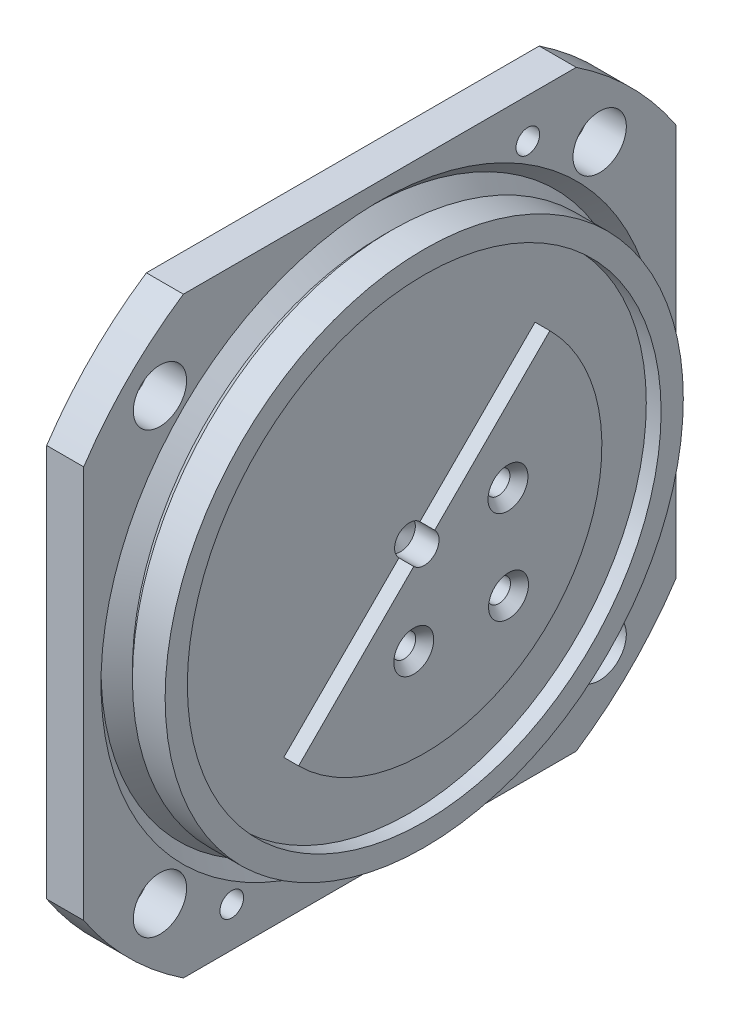
ISO-10303-21;
HEADER;
FILE_DESCRIPTION(('STEP AP214'),'2;1');
FILE_NAME('part.step','',(''),(''),'','','');
FILE_SCHEMA(('AUTOMOTIVE_DESIGN { 1 0 10303 214 1 1 1 1 }'));
ENDSEC;
DATA;
#1=APPLICATION_CONTEXT('core data for automotive mechanical design processes');
#2=APPLICATION_PROTOCOL_DEFINITION('international standard','automotive_design',2000,#1);
#3=PRODUCT_CONTEXT('',#1,'mechanical');
#4=PRODUCT('Part','Part','',(#3));
#5=PRODUCT_RELATED_PRODUCT_CATEGORY('part','',(#4));
#6=PRODUCT_DEFINITION_FORMATION('','',#4);
#7=PRODUCT_DEFINITION_CONTEXT('part definition',#1,'design');
#8=PRODUCT_DEFINITION('design','',#6,#7);
#9=PRODUCT_DEFINITION_SHAPE('','',#8);
#10=(LENGTH_UNIT() NAMED_UNIT(*) SI_UNIT(.MILLI.,.METRE.));
#11=(NAMED_UNIT(*) PLANE_ANGLE_UNIT() SI_UNIT($,.RADIAN.));
#12=(NAMED_UNIT(*) SI_UNIT($,.STERADIAN.) SOLID_ANGLE_UNIT());
#13=UNCERTAINTY_MEASURE_WITH_UNIT(LENGTH_MEASURE(1.E-05),#10,'distance_accuracy_value','');
#14=(GEOMETRIC_REPRESENTATION_CONTEXT(3) GLOBAL_UNCERTAINTY_ASSIGNED_CONTEXT((#13)) GLOBAL_UNIT_ASSIGNED_CONTEXT((#10,
#11,#12)) REPRESENTATION_CONTEXT('',''));
#15=CARTESIAN_POINT('',(0.,0.,0.));
#16=DIRECTION('',(0.,0.,1.));
#17=DIRECTION('',(1.,0.,0.));
#18=AXIS2_PLACEMENT_3D('',#15,#16,#17);
#19=CARTESIAN_POINT('',(0.401117335453598,0.0481695556244104,0.));
#20=DIRECTION('',(1.,0.,0.));
#21=DIRECTION('',(0.,0.,-1.));
#22=AXIS2_PLACEMENT_3D('',#19,#20,#21);
#23=CYLINDRICAL_SURFACE('',#22,17.5);
#24=CARTESIAN_POINT('',(1.50632617985044,0.0481695556244104,0.));
#25=DIRECTION('',(1.,0.,0.));
#26=DIRECTION('',(0.,0.,-1.));
#27=AXIS2_PLACEMENT_3D('',#24,#25,#26);
#28=CIRCLE('',#27,17.5);
#29=CARTESIAN_POINT('',(1.50632617985044,0.0481695556244104,-17.5));
#30=VERTEX_POINT('',#29);
#31=EDGE_CURVE('E19',#30,#30,#28,.T.);
#32=ORIENTED_EDGE('',*,*,#31,.F.);
#33=EDGE_LOOP('',(#32));
#34=FACE_BOUND('',#33,.T.);
#35=CARTESIAN_POINT('',(-0.704091508943475,0.0481695556244104,0.));
#36=DIRECTION('',(1.,0.,0.));
#37=DIRECTION('',(0.,1.,0.));
#38=AXIS2_PLACEMENT_3D('',#35,#36,#37);
#39=CIRCLE('',#38,17.5000000000002);
#40=CARTESIAN_POINT('',(-0.704091508943473,17.5481695556246,0.));
#41=VERTEX_POINT('',#40);
#42=EDGE_CURVE('E127',#41,#41,#39,.F.);
#43=ORIENTED_EDGE('',*,*,#42,.F.);
#44=EDGE_LOOP('',(#43));
#45=FACE_BOUND('',#44,.T.);
#46=ADVANCED_FACE('F16',(#34,#45),#23,.T.);
#47=CARTESIAN_POINT('',(1.50632617985044,8.79816955562441,0.));
#48=DIRECTION('',(1.,0.,0.));
#49=DIRECTION('',(0.,0.,-1.));
#50=AXIS2_PLACEMENT_3D('',#47,#48,#49);
#51=PLANE('',#50);
#52=CARTESIAN_POINT('',(1.50632617985044,0.0481695556244104,0.));
#53=DIRECTION('',(-1.,0.,0.));
#54=DIRECTION('',(0.,0.,1.));
#55=AXIS2_PLACEMENT_3D('',#52,#53,#54);
#56=CIRCLE('',#55,16.);
#57=CARTESIAN_POINT('',(1.50632617985044,0.0481695556244104,16.));
#58=VERTEX_POINT('',#57);
#59=EDGE_CURVE('E126',#58,#58,#56,.T.);
#60=ORIENTED_EDGE('',*,*,#59,.T.);
#61=EDGE_LOOP('',(#60));
#62=FACE_BOUND('',#61,.T.);
#63=ORIENTED_EDGE('',*,*,#31,.T.);
#64=EDGE_LOOP('',(#63));
#65=FACE_BOUND('',#64,.T.);
#66=ADVANCED_FACE('F251',(#62,#65),#51,.T.);
#67=CARTESIAN_POINT('',(-0.704091508943472,0.04816955562441,0.));
#68=DIRECTION('',(1.,0.,0.));
#69=DIRECTION('',(0.,0.,-1.));
#70=AXIS2_PLACEMENT_3D('',#67,#68,#69);
#71=CONICAL_SURFACE('',#70,17.5000000000002,0.785398163397466);
#72=ORIENTED_EDGE('',*,*,#42,.T.);
#73=EDGE_LOOP('',(#72));
#74=FACE_BOUND('',#73,.T.);
#75=CARTESIAN_POINT('',(-1.28154178579381,0.0481695556244104,0.));
#76=DIRECTION('',(-1.,0.,0.));
#77=DIRECTION('',(0.,1.,0.));
#78=AXIS2_PLACEMENT_3D('',#75,#76,#77);
#79=CIRCLE('',#78,16.9225497231494);
#80=CARTESIAN_POINT('',(-1.28154178579381,16.9707192787738,0.));
#81=VERTEX_POINT('',#80);
#82=EDGE_CURVE('E148',#81,#81,#79,.T.);
#83=ORIENTED_EDGE('',*,*,#82,.F.);
#84=EDGE_LOOP('',(#83));
#85=FACE_BOUND('',#84,.T.);
#86=ADVANCED_FACE('F258',(#74,#85),#71,.T.);
#87=CARTESIAN_POINT('',(1.50632617985044,0.0481695556244104,0.));
#88=DIRECTION('',(-1.,0.,0.));
#89=DIRECTION('',(0.,0.,1.));
#90=AXIS2_PLACEMENT_3D('',#87,#88,#89);
#91=CYLINDRICAL_SURFACE('',#90,16.);
#92=ORIENTED_EDGE('',*,*,#59,.F.);
#93=EDGE_LOOP('',(#92));
#94=FACE_BOUND('',#93,.T.);
#95=CARTESIAN_POINT('',(0.506326179850444,0.0481695556244104,0.));
#96=DIRECTION('',(-1.,0.,0.));
#97=DIRECTION('',(0.,0.,1.));
#98=AXIS2_PLACEMENT_3D('',#95,#96,#97);
#99=CIRCLE('',#98,16.);
#100=CARTESIAN_POINT('',(0.506326179850444,0.0481695556244104,16.));
#101=VERTEX_POINT('',#100);
#102=EDGE_CURVE('E146',#101,#101,#99,.F.);
#103=ORIENTED_EDGE('',*,*,#102,.F.);
#104=EDGE_LOOP('',(#103));
#105=FACE_BOUND('',#104,.T.);
#106=ADVANCED_FACE('F254',(#94,#105),#91,.F.);
#107=CARTESIAN_POINT('',(-2.34220195757365,0.04816955562441,0.));
#108=DIRECTION('',(-1.,0.,0.));
#109=DIRECTION('',(0.,0.,1.));
#110=AXIS2_PLACEMENT_3D('',#107,#108,#109);
#111=CONICAL_SURFACE('',#110,17.9832098949292,0.785398163397436);
#112=ORIENTED_EDGE('',*,*,#82,.T.);
#113=EDGE_LOOP('',(#112));
#114=FACE_BOUND('',#113,.T.);
#115=CARTESIAN_POINT('',(-2.34220195757364,0.0481695556244104,0.));
#116=DIRECTION('',(1.,0.,0.));
#117=DIRECTION('',(0.,1.,0.));
#118=AXIS2_PLACEMENT_3D('',#115,#116,#117);
#119=CIRCLE('',#118,17.9832098949297);
#120=CARTESIAN_POINT('',(-2.34220195757365,18.0313794505541,0.));
#121=VERTEX_POINT('',#120);
#122=EDGE_CURVE('E115',#121,#121,#119,.F.);
#123=ORIENTED_EDGE('',*,*,#122,.F.);
#124=EDGE_LOOP('',(#123));
#125=FACE_BOUND('',#124,.T.);
#126=ADVANCED_FACE('F257',(#114,#125),#111,.T.);
#127=CARTESIAN_POINT('',(-0.0936738202312881,0.0481695556244104,0.));
#128=DIRECTION('',(1.,0.,0.));
#129=DIRECTION('',(0.,0.,-1.));
#130=AXIS2_PLACEMENT_3D('',#127,#128,#129);
#131=CONICAL_SURFACE('',#130,0.99999999991951,1.02974425857823);
#132=CARTESIAN_POINT('',(-0.694534439247718,0.0481695556244104,-1.4210854715202E-10));
#133=VERTEX_POINT('',#132);
#134=VERTEX_LOOP('',#133);
#135=FACE_BOUND('',#134,.T.);
#136=CARTESIAN_POINT('',(-0.0936738201495557,0.0481695556244104,0.));
#137=DIRECTION('',(1.,0.,0.));
#138=DIRECTION('',(0.,1.,0.));
#139=AXIS2_PLACEMENT_3D('',#136,#137,#138);
#140=CIRCLE('',#139,1.);
#141=CARTESIAN_POINT('',(-0.0936738201495557,1.04816955562441,0.));
#142=VERTEX_POINT('',#141);
#143=EDGE_CURVE('E114',#142,#142,#140,.T.);
#144=ORIENTED_EDGE('',*,*,#143,.T.);
#145=EDGE_LOOP('',(#144));
#146=FACE_BOUND('',#145,.T.);
#147=ADVANCED_FACE('F264',(#135,#146),#131,.F.);
#148=CARTESIAN_POINT('',(0.506326179850444,0.0481695556244101,-1.45454545454545));
#149=DIRECTION('',(1.,0.,0.));
#150=DIRECTION('',(0.,1.,0.));
#151=AXIS2_PLACEMENT_3D('',#148,#149,#150);
#152=PLANE('',#151);
#153=ORIENTED_EDGE('',*,*,#102,.T.);
#154=EDGE_LOOP('',(#153));
#155=FACE_BOUND('',#154,.T.);
#156=CARTESIAN_POINT('',(0.506326179850444,0.0481695556244104,0.));
#157=DIRECTION('',(-1.,0.,0.));
#158=DIRECTION('',(0.,0.,1.));
#159=AXIS2_PLACEMENT_3D('',#156,#157,#158);
#160=CIRCLE('',#159,12.);
#161=CARTESIAN_POINT('',(0.506326179850444,-8.43711181861417,8.48528137423856));
#162=VERTEX_POINT('',#161);
#163=CARTESIAN_POINT('',(0.506326179850444,8.53345092986299,-8.48528137423857));
#164=VERTEX_POINT('',#163);
#165=EDGE_CURVE('E144',#162,#164,#160,.F.);
#166=ORIENTED_EDGE('',*,*,#165,.F.);
#167=DIRECTION('',(0.,-0.707106781186548,0.707106781186547));
#168=VECTOR('',#167,1.);
#169=CARTESIAN_POINT('',(0.506326179850444,0.0481695556244104,0.));
#170=LINE('',#169,#168);
#171=CARTESIAN_POINT('',(0.506326179850444,-0.658937225562138,0.707106781186547));
#172=VERTEX_POINT('',#171);
#173=EDGE_CURVE('E110',#172,#162,#170,.T.);
#174=ORIENTED_EDGE('',*,*,#173,.F.);
#175=CARTESIAN_POINT('',(0.506326179850444,0.0481695556244104,0.));
#176=DIRECTION('',(1.,0.,0.));
#177=DIRECTION('',(0.,1.,0.));
#178=AXIS2_PLACEMENT_3D('',#175,#176,#177);
#179=CIRCLE('',#178,1.);
#180=CARTESIAN_POINT('',(0.506326179850444,0.755276336810958,-0.707106781186548));
#181=VERTEX_POINT('',#180);
#182=EDGE_CURVE('E104',#172,#181,#179,.F.);
#183=ORIENTED_EDGE('',*,*,#182,.T.);
#184=DIRECTION('',(0.,-0.707106781186548,0.707106781186547));
#185=VECTOR('',#184,1.);
#186=CARTESIAN_POINT('',(0.506326179850444,0.0481695556244104,0.));
#187=LINE('',#186,#185);
#188=EDGE_CURVE('E109',#164,#181,#187,.T.);
#189=ORIENTED_EDGE('',*,*,#188,.F.);
#190=EDGE_LOOP('',(#166,#174,#183,#189));
#191=FACE_BOUND('',#190,.T.);
#192=ADVANCED_FACE('F107',(#155,#191),#152,.T.);
#193=CARTESIAN_POINT('',(-2.34220195757364,0.04816955562441,0.));
#194=DIRECTION('',(1.,0.,0.));
#195=DIRECTION('',(0.,0.,-1.));
#196=AXIS2_PLACEMENT_3D('',#193,#194,#195);
#197=CONICAL_SURFACE('',#196,17.9832098949297,0.785398163397462);
#198=ORIENTED_EDGE('',*,*,#122,.T.);
#199=EDGE_LOOP('',(#198));
#200=FACE_BOUND('',#199,.T.);
#201=CARTESIAN_POINT('',(-1.4936738201498,0.04816955562441,0.));
#202=DIRECTION('',(1.,0.,0.));
#203=DIRECTION('',(0.,0.,-1.));
#204=AXIS2_PLACEMENT_3D('',#201,#202,#203);
#205=CIRCLE('',#204,18.8317380323536);
#206=CARTESIAN_POINT('',(-1.4936738201498,0.04816955562441,-18.8317380323536));
#207=VERTEX_POINT('',#206);
#208=EDGE_CURVE('E133',#207,#207,#205,.F.);
#209=ORIENTED_EDGE('',*,*,#208,.F.);
#210=EDGE_LOOP('',(#209));
#211=FACE_BOUND('',#210,.T.);
#212=ADVANCED_FACE('F263',(#200,#211),#197,.F.);
#213=CARTESIAN_POINT('',(0.206326179850444,0.0481695556244104,0.));
#214=DIRECTION('',(1.,0.,0.));
#215=DIRECTION('',(0.,1.,0.));
#216=AXIS2_PLACEMENT_3D('',#213,#214,#215);
#217=CYLINDRICAL_SURFACE('',#216,1.);
#218=DIRECTION('',(1.,0.,0.));
#219=VECTOR('',#218,1.);
#220=CARTESIAN_POINT('',(0.206326179850444,0.755276336810958,-0.707106781186548));
#221=LINE('',#220,#219);
#222=CARTESIAN_POINT('',(1.50632617985044,0.755276336810958,-0.707106781186547));
#223=VERTEX_POINT('',#222);
#224=EDGE_CURVE('E119',#181,#223,#221,.T.);
#225=ORIENTED_EDGE('',*,*,#224,.F.);
#226=ORIENTED_EDGE('',*,*,#182,.F.);
#227=DIRECTION('',(1.,0.,0.));
#228=VECTOR('',#227,1.);
#229=CARTESIAN_POINT('',(1.50632617985044,-0.658937225562138,0.707106781186547));
#230=LINE('',#229,#228);
#231=CARTESIAN_POINT('',(1.50632617985044,-0.658937225562137,0.707106781186548));
#232=VERTEX_POINT('',#231);
#233=EDGE_CURVE('E141',#232,#172,#230,.F.);
#234=ORIENTED_EDGE('',*,*,#233,.F.);
#235=CARTESIAN_POINT('',(1.50632617985044,0.0481695556244104,0.));
#236=DIRECTION('',(1.,0.,0.));
#237=DIRECTION('',(0.,1.,0.));
#238=AXIS2_PLACEMENT_3D('',#235,#236,#237);
#239=CIRCLE('',#238,1.);
#240=EDGE_CURVE('E122',#223,#232,#239,.F.);
#241=ORIENTED_EDGE('',*,*,#240,.F.);
#242=EDGE_LOOP('',(#225,#226,#234,#241));
#243=FACE_BOUND('',#242,.T.);
#244=ORIENTED_EDGE('',*,*,#143,.F.);
#245=EDGE_LOOP('',(#244));
#246=FACE_BOUND('',#245,.T.);
#247=ADVANCED_FACE('F120',(#243,#246),#217,.F.);
#248=CARTESIAN_POINT('',(1.50632617985044,0.0481695556244104,0.));
#249=DIRECTION('',(0.,0.707106781186547,0.707106781186548));
#250=DIRECTION('',(0.,-0.707106781186548,0.707106781186547));
#251=AXIS2_PLACEMENT_3D('',#248,#249,#250);
#252=PLANE('',#251);
#253=DIRECTION('',(-1.,0.,0.));
#254=VECTOR('',#253,1.);
#255=CARTESIAN_POINT('',(1.50632617985044,-8.43711181861417,8.48528137423856));
#256=LINE('',#255,#254);
#257=CARTESIAN_POINT('',(1.50632617985044,-8.43711181861417,8.48528137423856));
#258=VERTEX_POINT('',#257);
#259=EDGE_CURVE('E137',#258,#162,#256,.T.);
#260=ORIENTED_EDGE('',*,*,#259,.F.);
#261=DIRECTION('',(0.,-0.707106781186548,0.707106781186547));
#262=VECTOR('',#261,1.);
#263=CARTESIAN_POINT('',(1.50632617985044,-0.658937225562137,0.707106781186547));
#264=LINE('',#263,#262);
#265=EDGE_CURVE('E244',#232,#258,#264,.T.);
#266=ORIENTED_EDGE('',*,*,#265,.F.);
#267=ORIENTED_EDGE('',*,*,#233,.T.);
#268=ORIENTED_EDGE('',*,*,#173,.T.);
#269=EDGE_LOOP('',(#260,#266,#267,#268));
#270=FACE_BOUND('',#269,.T.);
#271=ADVANCED_FACE('F384',(#270),#252,.T.);
#272=CARTESIAN_POINT('',(1.50632617985044,0.0481695556244104,0.));
#273=DIRECTION('',(-1.,0.,0.));
#274=DIRECTION('',(0.,0.,1.));
#275=AXIS2_PLACEMENT_3D('',#272,#273,#274);
#276=CYLINDRICAL_SURFACE('',#275,12.);
#277=CARTESIAN_POINT('',(1.50632617985044,0.0481695556244104,0.));
#278=DIRECTION('',(-1.,0.,0.));
#279=DIRECTION('',(0.,0.,1.));
#280=AXIS2_PLACEMENT_3D('',#277,#278,#279);
#281=CIRCLE('',#280,12.);
#282=CARTESIAN_POINT('',(1.50632617985044,8.53345092986299,-8.48528137423857));
#283=VERTEX_POINT('',#282);
#284=EDGE_CURVE('E242',#258,#283,#281,.F.);
#285=ORIENTED_EDGE('',*,*,#284,.F.);
#286=ORIENTED_EDGE('',*,*,#259,.T.);
#287=ORIENTED_EDGE('',*,*,#165,.T.);
#288=DIRECTION('',(1.,0.,0.));
#289=VECTOR('',#288,1.);
#290=CARTESIAN_POINT('',(1.50632617985044,8.53345092986299,-8.48528137423857));
#291=LINE('',#290,#289);
#292=EDGE_CURVE('E132',#283,#164,#291,.F.);
#293=ORIENTED_EDGE('',*,*,#292,.F.);
#294=EDGE_LOOP('',(#285,#286,#287,#293));
#295=FACE_BOUND('',#294,.T.);
#296=ADVANCED_FACE('F381',(#295),#276,.T.);
#297=CARTESIAN_POINT('',(1.50632617985044,0.0481695556244104,0.));
#298=DIRECTION('',(0.,0.707106781186547,0.707106781186548));
#299=DIRECTION('',(0.,-0.707106781186548,0.707106781186547));
#300=AXIS2_PLACEMENT_3D('',#297,#298,#299);
#301=PLANE('',#300);
#302=ORIENTED_EDGE('',*,*,#292,.T.);
#303=ORIENTED_EDGE('',*,*,#188,.T.);
#304=ORIENTED_EDGE('',*,*,#224,.T.);
#305=DIRECTION('',(0.,-0.707106781186548,0.707106781186547));
#306=VECTOR('',#305,1.);
#307=CARTESIAN_POINT('',(1.50632617985044,8.53345092986299,-8.48528137423857));
#308=LINE('',#307,#306);
#309=EDGE_CURVE('E241',#283,#223,#308,.T.);
#310=ORIENTED_EDGE('',*,*,#309,.F.);
#311=EDGE_LOOP('',(#302,#303,#304,#310));
#312=FACE_BOUND('',#311,.T.);
#313=ADVANCED_FACE('F130',(#312),#301,.T.);
#314=CARTESIAN_POINT('',(-1.49367382014956,21.4640385718011,0.));
#315=DIRECTION('',(1.,0.,0.));
#316=DIRECTION('',(0.,0.,-1.));
#317=AXIS2_PLACEMENT_3D('',#314,#315,#316);
#318=PLANE('',#317);
#319=ORIENTED_EDGE('',*,*,#208,.T.);
#320=EDGE_LOOP('',(#319));
#321=FACE_BOUND('',#320,.T.);
#322=DIRECTION('',(0.,1.,0.));
#323=VECTOR('',#322,1.);
#324=CARTESIAN_POINT('',(-1.49367382014956,-13.2183296057972,-20.));
#325=LINE('',#324,#323);
#326=CARTESIAN_POINT('',(-1.49367382014956,-13.2183296057972,-20.));
#327=VERTEX_POINT('',#326);
#328=CARTESIAN_POINT('',(-1.49367382014956,13.314668717046,-20.));
#329=VERTEX_POINT('',#328);
#330=EDGE_CURVE('E563',#327,#329,#325,.T.);
#331=ORIENTED_EDGE('',*,*,#330,.T.);
#332=CARTESIAN_POINT('',(-1.49367382014956,0.0481695556244104,0.));
#333=DIRECTION('',(1.,0.,0.));
#334=DIRECTION('',(0.,0.,-1.));
#335=AXIS2_PLACEMENT_3D('',#332,#333,#334);
#336=CIRCLE('',#335,24.);
#337=CARTESIAN_POINT('',(-1.49367382014956,20.0481695556244,-13.2664991614216));
#338=VERTEX_POINT('',#337);
#339=EDGE_CURVE('E218',#338,#329,#336,.F.);
#340=ORIENTED_EDGE('',*,*,#339,.F.);
#341=DIRECTION('',(0.,0.,-1.));
#342=VECTOR('',#341,1.);
#343=CARTESIAN_POINT('',(-1.49367382014956,20.0481695556244,-13.2664991614216));
#344=LINE('',#343,#342);
#345=CARTESIAN_POINT('',(-1.49367382014956,20.0481695556244,13.2664991614216));
#346=VERTEX_POINT('',#345);
#347=EDGE_CURVE('E225',#338,#346,#344,.F.);
#348=ORIENTED_EDGE('',*,*,#347,.T.);
#349=CARTESIAN_POINT('',(-1.49367382014956,0.0481695556244104,0.));
#350=DIRECTION('',(1.,0.,0.));
#351=DIRECTION('',(0.,0.,-1.));
#352=AXIS2_PLACEMENT_3D('',#349,#350,#351);
#353=CIRCLE('',#352,24.);
#354=CARTESIAN_POINT('',(-1.49367382014956,13.314668717046,20.));
#355=VERTEX_POINT('',#354);
#356=EDGE_CURVE('E206',#355,#346,#353,.F.);
#357=ORIENTED_EDGE('',*,*,#356,.F.);
#358=DIRECTION('',(0.,1.,0.));
#359=VECTOR('',#358,1.);
#360=CARTESIAN_POINT('',(-1.49367382014956,13.314668717046,20.));
#361=LINE('',#360,#359);
#362=CARTESIAN_POINT('',(-1.49367382014956,-13.2183296057972,20.));
#363=VERTEX_POINT('',#362);
#364=EDGE_CURVE('E604',#355,#363,#361,.F.);
#365=ORIENTED_EDGE('',*,*,#364,.T.);
#366=CARTESIAN_POINT('',(-1.49367382014956,0.0481695556244104,0.));
#367=DIRECTION('',(1.,0.,0.));
#368=DIRECTION('',(0.,0.,-1.));
#369=AXIS2_PLACEMENT_3D('',#366,#367,#368);
#370=CIRCLE('',#369,24.);
#371=CARTESIAN_POINT('',(-1.49367382014956,-19.9518304443756,13.2664991614216));
#372=VERTEX_POINT('',#371);
#373=EDGE_CURVE('E210',#372,#363,#370,.F.);
#374=ORIENTED_EDGE('',*,*,#373,.F.);
#375=DIRECTION('',(0.,0.,1.));
#376=VECTOR('',#375,1.);
#377=CARTESIAN_POINT('',(-1.49367382014956,-19.9518304443756,13.2664991614216));
#378=LINE('',#377,#376);
#379=CARTESIAN_POINT('',(-1.49367382014956,-19.9518304443756,-13.2664991614216));
#380=VERTEX_POINT('',#379);
#381=EDGE_CURVE('E594',#372,#380,#378,.F.);
#382=ORIENTED_EDGE('',*,*,#381,.T.);
#383=CARTESIAN_POINT('',(-1.49367382014956,0.0481695556244104,0.));
#384=DIRECTION('',(1.,0.,0.));
#385=DIRECTION('',(0.,0.,-1.));
#386=AXIS2_PLACEMENT_3D('',#383,#384,#385);
#387=CIRCLE('',#386,24.);
#388=EDGE_CURVE('E214',#327,#380,#387,.F.);
#389=ORIENTED_EDGE('',*,*,#388,.F.);
#390=EDGE_LOOP('',(#331,#340,#348,#357,#365,#374,#382,#389));
#391=FACE_BOUND('',#390,.T.);
#392=CARTESIAN_POINT('',(-1.49367382014955,-14.8010728492931,-14.8492424049175));
#393=DIRECTION('',(-1.,0.,0.));
#394=DIRECTION('',(0.,0.,1.));
#395=AXIS2_PLACEMENT_3D('',#392,#393,#394);
#396=CIRCLE('',#395,1.8);
#397=CARTESIAN_POINT('',(-1.49367382014955,-14.8010728492931,-13.0492424049175));
#398=VERTEX_POINT('',#397);
#399=EDGE_CURVE('E222',#398,#398,#396,.T.);
#400=ORIENTED_EDGE('',*,*,#399,.T.);
#401=EDGE_LOOP('',(#400));
#402=FACE_BOUND('',#401,.T.);
#403=CARTESIAN_POINT('',(-1.49367382014955,14.8974119605419,14.8492424049175));
#404=DIRECTION('',(-1.,0.,0.));
#405=DIRECTION('',(0.,0.,1.));
#406=AXIS2_PLACEMENT_3D('',#403,#404,#405);
#407=CIRCLE('',#406,1.8);
#408=CARTESIAN_POINT('',(-1.49367382014955,14.8974119605419,16.6492424049175));
#409=VERTEX_POINT('',#408);
#410=EDGE_CURVE('E226',#409,#409,#407,.T.);
#411=ORIENTED_EDGE('',*,*,#410,.T.);
#412=EDGE_LOOP('',(#411));
#413=FACE_BOUND('',#412,.T.);
#414=CARTESIAN_POINT('',(-1.49367382014955,14.8974119605419,-14.8492424049175));
#415=DIRECTION('',(-1.,0.,0.));
#416=DIRECTION('',(0.,0.,1.));
#417=AXIS2_PLACEMENT_3D('',#414,#415,#416);
#418=CIRCLE('',#417,1.8);
#419=CARTESIAN_POINT('',(-1.49367382014955,14.8974119605419,-13.0492424049175));
#420=VERTEX_POINT('',#419);
#421=EDGE_CURVE('E229',#420,#420,#418,.T.);
#422=ORIENTED_EDGE('',*,*,#421,.T.);
#423=EDGE_LOOP('',(#422));
#424=FACE_BOUND('',#423,.T.);
#425=CARTESIAN_POINT('',(-1.49367382014955,-14.8010728492931,14.8492424049175));
#426=DIRECTION('',(-1.,0.,0.));
#427=DIRECTION('',(0.,0.,1.));
#428=AXIS2_PLACEMENT_3D('',#425,#426,#427);
#429=CIRCLE('',#428,1.8);
#430=CARTESIAN_POINT('',(-1.49367382014955,-14.8010728492931,16.6492424049175));
#431=VERTEX_POINT('',#430);
#432=EDGE_CURVE('E232',#431,#431,#429,.T.);
#433=ORIENTED_EDGE('',*,*,#432,.T.);
#434=EDGE_LOOP('',(#433));
#435=FACE_BOUND('',#434,.T.);
#436=CARTESIAN_POINT('',(-1.49367382014956,17.3686776313132,-9.99999999999999));
#437=DIRECTION('',(1.,0.,0.));
#438=DIRECTION('',(0.,0.,-1.));
#439=AXIS2_PLACEMENT_3D('',#436,#437,#438);
#440=CIRCLE('',#439,0.8);
#441=CARTESIAN_POINT('',(-1.49367382014956,17.3686776313132,-10.8));
#442=VERTEX_POINT('',#441);
#443=EDGE_CURVE('E235',#442,#442,#440,.F.);
#444=ORIENTED_EDGE('',*,*,#443,.T.);
#445=EDGE_LOOP('',(#444));
#446=FACE_BOUND('',#445,.T.);
#447=CARTESIAN_POINT('',(-1.49367382014956,-17.2723385200644,10.));
#448=DIRECTION('',(1.,0.,0.));
#449=DIRECTION('',(0.,0.,-1.));
#450=AXIS2_PLACEMENT_3D('',#447,#448,#449);
#451=CIRCLE('',#450,0.8);
#452=CARTESIAN_POINT('',(-1.49367382014956,-17.2723385200644,9.2));
#453=VERTEX_POINT('',#452);
#454=EDGE_CURVE('E238',#453,#453,#451,.F.);
#455=ORIENTED_EDGE('',*,*,#454,.T.);
#456=EDGE_LOOP('',(#455));
#457=FACE_BOUND('',#456,.T.);
#458=ADVANCED_FACE('F374',(#321,#391,#402,#413,#424,#435,#446,#457),#318,.T.);
#459=CARTESIAN_POINT('',(1.50632617985044,8.79816955562441,0.));
#460=DIRECTION('',(1.,0.,0.));
#461=DIRECTION('',(0.,0.,-1.));
#462=AXIS2_PLACEMENT_3D('',#459,#460,#461);
#463=PLANE('',#462);
#464=ORIENTED_EDGE('',*,*,#284,.T.);
#465=ORIENTED_EDGE('',*,*,#309,.T.);
#466=ORIENTED_EDGE('',*,*,#240,.T.);
#467=ORIENTED_EDGE('',*,*,#265,.T.);
#468=EDGE_LOOP('',(#464,#465,#466,#467));
#469=FACE_BOUND('',#468,.T.);
#470=CARTESIAN_POINT('',(1.50632617976498,-5.57125271637753,-5.69428622698282));
#471=DIRECTION('',(1.,0.,0.));
#472=DIRECTION('',(0.,0.,-1.));
#473=AXIS2_PLACEMENT_3D('',#470,#471,#472);
#474=CIRCLE('',#473,1.34999999997481);
#475=CARTESIAN_POINT('',(1.50632617976498,-5.57125271637753,-7.04428622695763));
#476=VERTEX_POINT('',#475);
#477=EDGE_CURVE('E197',#476,#476,#474,.F.);
#478=ORIENTED_EDGE('',*,*,#477,.T.);
#479=EDGE_LOOP('',(#478));
#480=FACE_BOUND('',#479,.T.);
#481=CARTESIAN_POINT('',(1.50632617987867,0.75527633681096,-5.65685424949238));
#482=DIRECTION('',(1.,0.,0.));
#483=DIRECTION('',(0.,1.,0.));
#484=AXIS2_PLACEMENT_3D('',#481,#482,#483);
#485=CIRCLE('',#484,1.3500000000105);
#486=CARTESIAN_POINT('',(1.50632617987867,2.10527633682146,-5.65685424949238));
#487=VERTEX_POINT('',#486);
#488=EDGE_CURVE('E200',#487,#487,#485,.F.);
#489=ORIENTED_EDGE('',*,*,#488,.T.);
#490=EDGE_LOOP('',(#489));
#491=FACE_BOUND('',#490,.T.);
#492=CARTESIAN_POINT('',(1.50632617976498,-5.60868469386797,0.707106781186545));
#493=DIRECTION('',(1.,0.,0.));
#494=DIRECTION('',(0.,0.,-1.));
#495=AXIS2_PLACEMENT_3D('',#492,#493,#494);
#496=CIRCLE('',#495,1.34999999999205);
#497=CARTESIAN_POINT('',(1.50632617976498,-5.60868469386797,-0.64289321880551));
#498=VERTEX_POINT('',#497);
#499=EDGE_CURVE('E203',#498,#498,#496,.F.);
#500=ORIENTED_EDGE('',*,*,#499,.T.);
#501=EDGE_LOOP('',(#500));
#502=FACE_BOUND('',#501,.T.);
#503=ADVANCED_FACE('F370',(#469,#480,#491,#502),#463,.T.);
#504=CARTESIAN_POINT('',(-58.3289621540712,-17.2723385200644,10.));
#505=DIRECTION('',(1.,0.,0.));
#506=DIRECTION('',(0.,0.,-1.));
#507=AXIS2_PLACEMENT_3D('',#504,#505,#506);
#508=CYLINDRICAL_SURFACE('',#507,0.8);
#509=ORIENTED_EDGE('',*,*,#454,.F.);
#510=EDGE_LOOP('',(#509));
#511=FACE_BOUND('',#510,.T.);
#512=CARTESIAN_POINT('',(-3.99367382014956,-17.2723385200644,10.));
#513=DIRECTION('',(1.,0.,0.));
#514=DIRECTION('',(0.,0.,-1.));
#515=AXIS2_PLACEMENT_3D('',#512,#513,#514);
#516=CIRCLE('',#515,0.8);
#517=CARTESIAN_POINT('',(-3.99367382014956,-17.2723385200644,9.2));
#518=VERTEX_POINT('',#517);
#519=EDGE_CURVE('E194',#518,#518,#516,.T.);
#520=ORIENTED_EDGE('',*,*,#519,.F.);
#521=EDGE_LOOP('',(#520));
#522=FACE_BOUND('',#521,.T.);
#523=ADVANCED_FACE('F366',(#511,#522),#508,.F.);
#524=CARTESIAN_POINT('',(-58.3289621540712,17.3686776313132,-9.99999999999999));
#525=DIRECTION('',(1.,0.,0.));
#526=DIRECTION('',(0.,0.,-1.));
#527=AXIS2_PLACEMENT_3D('',#524,#525,#526);
#528=CYLINDRICAL_SURFACE('',#527,0.8);
#529=ORIENTED_EDGE('',*,*,#443,.F.);
#530=EDGE_LOOP('',(#529));
#531=FACE_BOUND('',#530,.T.);
#532=CARTESIAN_POINT('',(-3.99367382014956,17.3686776313132,-9.99999999999999));
#533=DIRECTION('',(1.,0.,0.));
#534=DIRECTION('',(0.,0.,-1.));
#535=AXIS2_PLACEMENT_3D('',#532,#533,#534);
#536=CIRCLE('',#535,0.8);
#537=CARTESIAN_POINT('',(-3.99367382014956,17.3686776313132,-10.8));
#538=VERTEX_POINT('',#537);
#539=EDGE_CURVE('E191',#538,#538,#536,.T.);
#540=ORIENTED_EDGE('',*,*,#539,.F.);
#541=EDGE_LOOP('',(#540));
#542=FACE_BOUND('',#541,.T.);
#543=ADVANCED_FACE('F362',(#531,#542),#528,.F.);
#544=CARTESIAN_POINT('',(52.8416145137721,-14.8010728492931,14.8492424049175));
#545=DIRECTION('',(-1.,0.,0.));
#546=DIRECTION('',(0.,0.,1.));
#547=AXIS2_PLACEMENT_3D('',#544,#545,#546);
#548=CYLINDRICAL_SURFACE('',#547,1.8);
#549=CARTESIAN_POINT('',(-3.99367382014956,-14.8010728492931,14.8492424049175));
#550=DIRECTION('',(-1.,0.,0.));
#551=DIRECTION('',(0.,0.,1.));
#552=AXIS2_PLACEMENT_3D('',#549,#550,#551);
#553=CIRCLE('',#552,1.8);
#554=CARTESIAN_POINT('',(-3.99367382014956,-14.8010728492931,16.6492424049175));
#555=VERTEX_POINT('',#554);
#556=EDGE_CURVE('E188',#555,#555,#553,.F.);
#557=ORIENTED_EDGE('',*,*,#556,.F.);
#558=EDGE_LOOP('',(#557));
#559=FACE_BOUND('',#558,.T.);
#560=ORIENTED_EDGE('',*,*,#432,.F.);
#561=EDGE_LOOP('',(#560));
#562=FACE_BOUND('',#561,.T.);
#563=ADVANCED_FACE('F358',(#559,#562),#548,.F.);
#564=CARTESIAN_POINT('',(52.8416145137721,14.8974119605419,-14.8492424049175));
#565=DIRECTION('',(-1.,0.,0.));
#566=DIRECTION('',(0.,0.,1.));
#567=AXIS2_PLACEMENT_3D('',#564,#565,#566);
#568=CYLINDRICAL_SURFACE('',#567,1.8);
#569=CARTESIAN_POINT('',(-3.99367382014956,14.8974119605419,-14.8492424049175));
#570=DIRECTION('',(-1.,0.,0.));
#571=DIRECTION('',(0.,0.,1.));
#572=AXIS2_PLACEMENT_3D('',#569,#570,#571);
#573=CIRCLE('',#572,1.8);
#574=CARTESIAN_POINT('',(-3.99367382014956,14.8974119605419,-13.0492424049175));
#575=VERTEX_POINT('',#574);
#576=EDGE_CURVE('E185',#575,#575,#573,.F.);
#577=ORIENTED_EDGE('',*,*,#576,.F.);
#578=EDGE_LOOP('',(#577));
#579=FACE_BOUND('',#578,.T.);
#580=ORIENTED_EDGE('',*,*,#421,.F.);
#581=EDGE_LOOP('',(#580));
#582=FACE_BOUND('',#581,.T.);
#583=ADVANCED_FACE('F354',(#579,#582),#568,.F.);
#584=CARTESIAN_POINT('',(52.8416145137721,14.8974119605419,14.8492424049175));
#585=DIRECTION('',(-1.,0.,0.));
#586=DIRECTION('',(0.,0.,1.));
#587=AXIS2_PLACEMENT_3D('',#584,#585,#586);
#588=CYLINDRICAL_SURFACE('',#587,1.8);
#589=CARTESIAN_POINT('',(-3.99367382014956,14.8974119605419,14.8492424049175));
#590=DIRECTION('',(-1.,0.,0.));
#591=DIRECTION('',(0.,0.,1.));
#592=AXIS2_PLACEMENT_3D('',#589,#590,#591);
#593=CIRCLE('',#592,1.8);
#594=CARTESIAN_POINT('',(-3.99367382014956,14.8974119605419,16.6492424049175));
#595=VERTEX_POINT('',#594);
#596=EDGE_CURVE('E182',#595,#595,#593,.F.);
#597=ORIENTED_EDGE('',*,*,#596,.F.);
#598=EDGE_LOOP('',(#597));
#599=FACE_BOUND('',#598,.T.);
#600=ORIENTED_EDGE('',*,*,#410,.F.);
#601=EDGE_LOOP('',(#600));
#602=FACE_BOUND('',#601,.T.);
#603=ADVANCED_FACE('F350',(#599,#602),#588,.F.);
#604=CARTESIAN_POINT('',(52.8416145137721,-14.8010728492931,-14.8492424049175));
#605=DIRECTION('',(-1.,0.,0.));
#606=DIRECTION('',(0.,0.,1.));
#607=AXIS2_PLACEMENT_3D('',#604,#605,#606);
#608=CYLINDRICAL_SURFACE('',#607,1.8);
#609=CARTESIAN_POINT('',(-3.99367382014956,-14.8010728492931,-14.8492424049175));
#610=DIRECTION('',(-1.,0.,0.));
#611=DIRECTION('',(0.,0.,1.));
#612=AXIS2_PLACEMENT_3D('',#609,#610,#611);
#613=CIRCLE('',#612,1.8);
#614=CARTESIAN_POINT('',(-3.99367382014956,-14.8010728492931,-13.0492424049175));
#615=VERTEX_POINT('',#614);
#616=EDGE_CURVE('E179',#615,#615,#613,.F.);
#617=ORIENTED_EDGE('',*,*,#616,.F.);
#618=EDGE_LOOP('',(#617));
#619=FACE_BOUND('',#618,.T.);
#620=ORIENTED_EDGE('',*,*,#399,.F.);
#621=EDGE_LOOP('',(#620));
#622=FACE_BOUND('',#621,.T.);
#623=ADVANCED_FACE('F346',(#619,#622),#608,.F.);
#624=CARTESIAN_POINT('',(-3.99367382014956,20.0481695556244,-13.2664991614216));
#625=DIRECTION('',(0.,-1.,0.));
#626=DIRECTION('',(0.,0.,-1.));
#627=AXIS2_PLACEMENT_3D('',#624,#625,#626);
#628=PLANE('',#627);
#629=DIRECTION('',(1.,0.,0.));
#630=VECTOR('',#629,1.);
#631=CARTESIAN_POINT('',(-2.74367382014956,20.0481695556244,-13.2664991614216));
#632=LINE('',#631,#630);
#633=CARTESIAN_POINT('',(-3.99367382014956,20.0481695556244,-13.2664991614216));
#634=VERTEX_POINT('',#633);
#635=EDGE_CURVE('E221',#634,#338,#632,.T.);
#636=ORIENTED_EDGE('',*,*,#635,.F.);
#637=DIRECTION('',(0.,0.,1.));
#638=VECTOR('',#637,1.);
#639=CARTESIAN_POINT('',(-3.99367382014956,20.0481695556244,0.));
#640=LINE('',#639,#638);
#641=CARTESIAN_POINT('',(-3.99367382014956,20.0481695556244,13.2664991614216));
#642=VERTEX_POINT('',#641);
#643=EDGE_CURVE('E178',#642,#634,#640,.F.);
#644=ORIENTED_EDGE('',*,*,#643,.F.);
#645=DIRECTION('',(1.,0.,0.));
#646=VECTOR('',#645,1.);
#647=CARTESIAN_POINT('',(-2.74367382014956,20.0481695556244,13.2664991614216));
#648=LINE('',#647,#646);
#649=EDGE_CURVE('E606',#346,#642,#648,.F.);
#650=ORIENTED_EDGE('',*,*,#649,.F.);
#651=ORIENTED_EDGE('',*,*,#347,.F.);
#652=EDGE_LOOP('',(#636,#644,#650,#651));
#653=FACE_BOUND('',#652,.T.);
#654=ADVANCED_FACE('F342',(#653),#628,.F.);
#655=CARTESIAN_POINT('',(-2.74367382014956,0.0481695556244104,0.));
#656=DIRECTION('',(1.,0.,0.));
#657=DIRECTION('',(0.,0.,-1.));
#658=AXIS2_PLACEMENT_3D('',#655,#656,#657);
#659=CYLINDRICAL_SURFACE('',#658,24.);
#660=DIRECTION('',(1.,0.,0.));
#661=VECTOR('',#660,1.);
#662=CARTESIAN_POINT('',(-3.99367382014956,13.314668717046,-20.));
#663=LINE('',#662,#661);
#664=CARTESIAN_POINT('',(-3.99367382014956,13.314668717046,-20.));
#665=VERTEX_POINT('',#664);
#666=EDGE_CURVE('E220',#329,#665,#663,.F.);
#667=ORIENTED_EDGE('',*,*,#666,.T.);
#668=CARTESIAN_POINT('',(-3.99367382014956,0.0481695556244104,0.));
#669=DIRECTION('',(1.,0.,0.));
#670=DIRECTION('',(0.,0.,-1.));
#671=AXIS2_PLACEMENT_3D('',#668,#669,#670);
#672=CIRCLE('',#671,24.);
#673=EDGE_CURVE('E176',#634,#665,#672,.F.);
#674=ORIENTED_EDGE('',*,*,#673,.F.);
#675=ORIENTED_EDGE('',*,*,#635,.T.);
#676=ORIENTED_EDGE('',*,*,#339,.T.);
#677=EDGE_LOOP('',(#667,#674,#675,#676));
#678=FACE_BOUND('',#677,.T.);
#679=ADVANCED_FACE('F338',(#678),#659,.T.);
#680=CARTESIAN_POINT('',(-3.99367382014956,-13.2183296057972,-20.));
#681=DIRECTION('',(0.,0.,1.));
#682=DIRECTION('',(1.,0.,0.));
#683=AXIS2_PLACEMENT_3D('',#680,#681,#682);
#684=PLANE('',#683);
#685=DIRECTION('',(1.,0.,0.));
#686=VECTOR('',#685,1.);
#687=CARTESIAN_POINT('',(-2.74367382014956,-13.2183296057972,-20.));
#688=LINE('',#687,#686);
#689=CARTESIAN_POINT('',(-3.99367382014956,-13.2183296057972,-20.));
#690=VERTEX_POINT('',#689);
#691=EDGE_CURVE('E217',#690,#327,#688,.T.);
#692=ORIENTED_EDGE('',*,*,#691,.F.);
#693=DIRECTION('',(0.,1.,0.));
#694=VECTOR('',#693,1.);
#695=CARTESIAN_POINT('',(-3.99367382014956,12.0481695556244,-20.));
#696=LINE('',#695,#694);
#697=EDGE_CURVE('E175',#665,#690,#696,.F.);
#698=ORIENTED_EDGE('',*,*,#697,.F.);
#699=ORIENTED_EDGE('',*,*,#666,.F.);
#700=ORIENTED_EDGE('',*,*,#330,.F.);
#701=EDGE_LOOP('',(#692,#698,#699,#700));
#702=FACE_BOUND('',#701,.T.);
#703=ADVANCED_FACE('F334',(#702),#684,.F.);
#704=CARTESIAN_POINT('',(-2.74367382014956,0.0481695556244104,0.));
#705=DIRECTION('',(1.,0.,0.));
#706=DIRECTION('',(0.,0.,-1.));
#707=AXIS2_PLACEMENT_3D('',#704,#705,#706);
#708=CYLINDRICAL_SURFACE('',#707,24.);
#709=DIRECTION('',(1.,0.,0.));
#710=VECTOR('',#709,1.);
#711=CARTESIAN_POINT('',(-3.99367382014956,-19.9518304443756,-13.2664991614216));
#712=LINE('',#711,#710);
#713=CARTESIAN_POINT('',(-3.99367382014956,-19.9518304443756,-13.2664991614216));
#714=VERTEX_POINT('',#713);
#715=EDGE_CURVE('E216',#380,#714,#712,.F.);
#716=ORIENTED_EDGE('',*,*,#715,.T.);
#717=CARTESIAN_POINT('',(-3.99367382014956,0.0481695556244104,0.));
#718=DIRECTION('',(1.,0.,0.));
#719=DIRECTION('',(0.,0.,-1.));
#720=AXIS2_PLACEMENT_3D('',#717,#718,#719);
#721=CIRCLE('',#720,24.);
#722=EDGE_CURVE('E173',#690,#714,#721,.F.);
#723=ORIENTED_EDGE('',*,*,#722,.F.);
#724=ORIENTED_EDGE('',*,*,#691,.T.);
#725=ORIENTED_EDGE('',*,*,#388,.T.);
#726=EDGE_LOOP('',(#716,#723,#724,#725));
#727=FACE_BOUND('',#726,.T.);
#728=ADVANCED_FACE('F330',(#727),#708,.T.);
#729=CARTESIAN_POINT('',(-3.99367382014956,-19.9518304443756,13.2664991614216));
#730=DIRECTION('',(0.,1.,0.));
#731=DIRECTION('',(0.,0.,1.));
#732=AXIS2_PLACEMENT_3D('',#729,#730,#731);
#733=PLANE('',#732);
#734=DIRECTION('',(1.,0.,0.));
#735=VECTOR('',#734,1.);
#736=CARTESIAN_POINT('',(-2.74367382014956,-19.9518304443756,13.2664991614216));
#737=LINE('',#736,#735);
#738=CARTESIAN_POINT('',(-3.99367382014956,-19.9518304443756,13.2664991614216));
#739=VERTEX_POINT('',#738);
#740=EDGE_CURVE('E213',#739,#372,#737,.T.);
#741=ORIENTED_EDGE('',*,*,#740,.F.);
#742=DIRECTION('',(0.,0.,1.));
#743=VECTOR('',#742,1.);
#744=CARTESIAN_POINT('',(-3.99367382014956,-19.9518304443756,0.));
#745=LINE('',#744,#743);
#746=EDGE_CURVE('E172',#714,#739,#745,.T.);
#747=ORIENTED_EDGE('',*,*,#746,.F.);
#748=ORIENTED_EDGE('',*,*,#715,.F.);
#749=ORIENTED_EDGE('',*,*,#381,.F.);
#750=EDGE_LOOP('',(#741,#747,#748,#749));
#751=FACE_BOUND('',#750,.T.);
#752=ADVANCED_FACE('F326',(#751),#733,.F.);
#753=CARTESIAN_POINT('',(-2.74367382014956,0.0481695556244104,0.));
#754=DIRECTION('',(1.,0.,0.));
#755=DIRECTION('',(0.,0.,-1.));
#756=AXIS2_PLACEMENT_3D('',#753,#754,#755);
#757=CYLINDRICAL_SURFACE('',#756,24.);
#758=ORIENTED_EDGE('',*,*,#740,.T.);
#759=ORIENTED_EDGE('',*,*,#373,.T.);
#760=DIRECTION('',(-1.,0.,0.));
#761=VECTOR('',#760,1.);
#762=CARTESIAN_POINT('',(-3.99367382014956,-13.2183296057972,20.));
#763=LINE('',#762,#761);
#764=CARTESIAN_POINT('',(-3.99367382014956,-13.2183296057972,20.));
#765=VERTEX_POINT('',#764);
#766=EDGE_CURVE('E212',#363,#765,#763,.T.);
#767=ORIENTED_EDGE('',*,*,#766,.T.);
#768=CARTESIAN_POINT('',(-3.99367382014956,0.0481695556244104,0.));
#769=DIRECTION('',(1.,0.,0.));
#770=DIRECTION('',(0.,0.,-1.));
#771=AXIS2_PLACEMENT_3D('',#768,#769,#770);
#772=CIRCLE('',#771,24.);
#773=EDGE_CURVE('E170',#739,#765,#772,.F.);
#774=ORIENTED_EDGE('',*,*,#773,.F.);
#775=EDGE_LOOP('',(#758,#759,#767,#774));
#776=FACE_BOUND('',#775,.T.);
#777=ADVANCED_FACE('F322',(#776),#757,.T.);
#778=CARTESIAN_POINT('',(-3.99367382014956,13.314668717046,20.));
#779=DIRECTION('',(0.,0.,-1.));
#780=DIRECTION('',(-1.,0.,0.));
#781=AXIS2_PLACEMENT_3D('',#778,#779,#780);
#782=PLANE('',#781);
#783=DIRECTION('',(1.,0.,0.));
#784=VECTOR('',#783,1.);
#785=CARTESIAN_POINT('',(-2.74367382014956,13.314668717046,20.));
#786=LINE('',#785,#784);
#787=CARTESIAN_POINT('',(-3.99367382014956,13.314668717046,20.));
#788=VERTEX_POINT('',#787);
#789=EDGE_CURVE('E209',#788,#355,#786,.T.);
#790=ORIENTED_EDGE('',*,*,#789,.F.);
#791=DIRECTION('',(0.,1.,0.));
#792=VECTOR('',#791,1.);
#793=CARTESIAN_POINT('',(-3.99367382014956,12.0481695556244,20.));
#794=LINE('',#793,#792);
#795=EDGE_CURVE('E34',#765,#788,#794,.T.);
#796=ORIENTED_EDGE('',*,*,#795,.F.);
#797=ORIENTED_EDGE('',*,*,#766,.F.);
#798=ORIENTED_EDGE('',*,*,#364,.F.);
#799=EDGE_LOOP('',(#790,#796,#797,#798));
#800=FACE_BOUND('',#799,.T.);
#801=ADVANCED_FACE('F318',(#800),#782,.F.);
#802=CARTESIAN_POINT('',(-2.74367382014956,0.0481695556244104,0.));
#803=DIRECTION('',(1.,0.,0.));
#804=DIRECTION('',(0.,0.,-1.));
#805=AXIS2_PLACEMENT_3D('',#802,#803,#804);
#806=CYLINDRICAL_SURFACE('',#805,24.);
#807=ORIENTED_EDGE('',*,*,#789,.T.);
#808=ORIENTED_EDGE('',*,*,#356,.T.);
#809=ORIENTED_EDGE('',*,*,#649,.T.);
#810=CARTESIAN_POINT('',(-3.99367382014956,0.0481695556244104,0.));
#811=DIRECTION('',(1.,0.,0.));
#812=DIRECTION('',(0.,0.,-1.));
#813=AXIS2_PLACEMENT_3D('',#810,#811,#812);
#814=CIRCLE('',#813,24.);
#815=EDGE_CURVE('E167',#788,#642,#814,.F.);
#816=ORIENTED_EDGE('',*,*,#815,.F.);
#817=EDGE_LOOP('',(#807,#808,#809,#816));
#818=FACE_BOUND('',#817,.T.);
#819=ADVANCED_FACE('F314',(#818),#806,.T.);
#820=CARTESIAN_POINT('',(1.50632617970814,-5.60868469386797,0.707106781186545));
#821=DIRECTION('',(1.,0.,0.));
#822=DIRECTION('',(0.,0.,-1.));
#823=AXIS2_PLACEMENT_3D('',#820,#821,#822);
#824=CONICAL_SURFACE('',#823,1.34999999994264,0.715584993325728);
#825=CARTESIAN_POINT('',(0.854642477159745,-5.60868469386797,0.707106781186545));
#826=DIRECTION('',(1.,0.,0.));
#827=DIRECTION('',(0.,0.,-1.));
#828=AXIS2_PLACEMENT_3D('',#825,#826,#827);
#829=CIRCLE('',#828,0.7835);
#830=CARTESIAN_POINT('',(0.854642477159745,-5.60868469386797,-0.0763932188134552));
#831=VERTEX_POINT('',#830);
#832=EDGE_CURVE('E169',#831,#831,#829,.F.);
#833=ORIENTED_EDGE('',*,*,#832,.T.);
#834=EDGE_LOOP('',(#833));
#835=FACE_BOUND('',#834,.T.);
#836=ORIENTED_EDGE('',*,*,#499,.F.);
#837=EDGE_LOOP('',(#836));
#838=FACE_BOUND('',#837,.T.);
#839=ADVANCED_FACE('F310',(#835,#838),#824,.F.);
#840=CARTESIAN_POINT('',(1.50632617970814,0.75527633681096,-5.65685424949238));
#841=DIRECTION('',(1.,0.,0.));
#842=DIRECTION('',(0.,1.,0.));
#843=AXIS2_PLACEMENT_3D('',#840,#841,#842);
#844=CONICAL_SURFACE('',#843,1.34999999986226,0.715584993301556);
#845=CARTESIAN_POINT('',(0.854642477159745,0.75527633681096,-5.65685424949238));
#846=DIRECTION('',(1.,0.,0.));
#847=DIRECTION('',(0.,0.,-1.));
#848=AXIS2_PLACEMENT_3D('',#845,#846,#847);
#849=CIRCLE('',#848,0.7835);
#850=CARTESIAN_POINT('',(0.854642477159745,0.75527633681096,-6.44035424949238));
#851=VERTEX_POINT('',#850);
#852=EDGE_CURVE('E623',#851,#851,#849,.F.);
#853=ORIENTED_EDGE('',*,*,#852,.T.);
#854=EDGE_LOOP('',(#853));
#855=FACE_BOUND('',#854,.T.);
#856=ORIENTED_EDGE('',*,*,#488,.F.);
#857=EDGE_LOOP('',(#856));
#858=FACE_BOUND('',#857,.T.);
#859=ADVANCED_FACE('F306',(#855,#858),#844,.F.);
#860=CARTESIAN_POINT('',(1.50632617953761,-5.57125271637753,-5.69428622698282));
#861=DIRECTION('',(1.,0.,0.));
#862=DIRECTION('',(0.,0.,-1.));
#863=AXIS2_PLACEMENT_3D('',#860,#861,#862);
#864=CONICAL_SURFACE('',#863,1.34999999977716,0.715584993301556);
#865=CARTESIAN_POINT('',(0.854642477159745,-5.57125271637753,-5.69428622698282));
#866=DIRECTION('',(1.,0.,0.));
#867=DIRECTION('',(0.,0.,-1.));
#868=AXIS2_PLACEMENT_3D('',#865,#866,#867);
#869=CIRCLE('',#868,0.7835);
#870=CARTESIAN_POINT('',(0.854642477159745,-5.57125271637753,-6.47778622698282));
#871=VERTEX_POINT('',#870);
#872=EDGE_CURVE('E166',#871,#871,#869,.F.);
#873=ORIENTED_EDGE('',*,*,#872,.T.);
#874=EDGE_LOOP('',(#873));
#875=FACE_BOUND('',#874,.T.);
#876=ORIENTED_EDGE('',*,*,#477,.F.);
#877=EDGE_LOOP('',(#876));
#878=FACE_BOUND('',#877,.T.);
#879=ADVANCED_FACE('F303',(#875,#878),#864,.F.);
#880=CARTESIAN_POINT('',(-3.99367382014956,12.0481695556244,0.));
#881=DIRECTION('',(-1.,0.,0.));
#882=DIRECTION('',(0.,0.,1.));
#883=AXIS2_PLACEMENT_3D('',#880,#881,#882);
#884=PLANE('',#883);
#885=ORIENTED_EDGE('',*,*,#795,.T.);
#886=ORIENTED_EDGE('',*,*,#815,.T.);
#887=ORIENTED_EDGE('',*,*,#643,.T.);
#888=ORIENTED_EDGE('',*,*,#673,.T.);
#889=ORIENTED_EDGE('',*,*,#697,.T.);
#890=ORIENTED_EDGE('',*,*,#722,.T.);
#891=ORIENTED_EDGE('',*,*,#746,.T.);
#892=ORIENTED_EDGE('',*,*,#773,.T.);
#893=EDGE_LOOP('',(#885,#886,#887,#888,#889,#890,#891,#892));
#894=FACE_BOUND('',#893,.T.);
#895=CARTESIAN_POINT('',(-3.99367382014956,0.0481695556244111,0.));
#896=DIRECTION('',(-1.,0.,0.));
#897=DIRECTION('',(0.,0.,1.));
#898=AXIS2_PLACEMENT_3D('',#895,#896,#897);
#899=CIRCLE('',#898,16.);
#900=CARTESIAN_POINT('',(-3.99367382014956,0.0481695556244111,16.));
#901=VERTEX_POINT('',#900);
#902=EDGE_CURVE('E163',#901,#901,#899,.F.);
#903=ORIENTED_EDGE('',*,*,#902,.T.);
#904=EDGE_LOOP('',(#903));
#905=FACE_BOUND('',#904,.T.);
#906=ORIENTED_EDGE('',*,*,#616,.T.);
#907=EDGE_LOOP('',(#906));
#908=FACE_BOUND('',#907,.T.);
#909=ORIENTED_EDGE('',*,*,#596,.T.);
#910=EDGE_LOOP('',(#909));
#911=FACE_BOUND('',#910,.T.);
#912=ORIENTED_EDGE('',*,*,#576,.T.);
#913=EDGE_LOOP('',(#912));
#914=FACE_BOUND('',#913,.T.);
#915=ORIENTED_EDGE('',*,*,#556,.T.);
#916=EDGE_LOOP('',(#915));
#917=FACE_BOUND('',#916,.T.);
#918=ORIENTED_EDGE('',*,*,#539,.T.);
#919=EDGE_LOOP('',(#918));
#920=FACE_BOUND('',#919,.T.);
#921=ORIENTED_EDGE('',*,*,#519,.T.);
#922=EDGE_LOOP('',(#921));
#923=FACE_BOUND('',#922,.T.);
#924=ADVANCED_FACE('F299',(#894,#905,#908,#911,#914,#917,#920,#923),#884,.T.);
#925=CARTESIAN_POINT('',(-55.3289621540712,-5.60868469386797,0.707106781186545));
#926=DIRECTION('',(1.,0.,0.));
#927=DIRECTION('',(0.,0.,-1.));
#928=AXIS2_PLACEMENT_3D('',#925,#926,#927);
#929=CYLINDRICAL_SURFACE('',#928,0.7835);
#930=CARTESIAN_POINT('',(-1.49367382014955,-5.60868469386797,0.707106781186545));
#931=DIRECTION('',(1.,0.,0.));
#932=DIRECTION('',(0.,0.,-1.));
#933=AXIS2_PLACEMENT_3D('',#930,#931,#932);
#934=CIRCLE('',#933,0.7835);
#935=CARTESIAN_POINT('',(-1.49367382014955,-5.60868469386797,-0.0763932188134552));
#936=VERTEX_POINT('',#935);
#937=EDGE_CURVE('E160',#936,#936,#934,.F.);
#938=ORIENTED_EDGE('',*,*,#937,.T.);
#939=EDGE_LOOP('',(#938));
#940=FACE_BOUND('',#939,.T.);
#941=ORIENTED_EDGE('',*,*,#832,.F.);
#942=EDGE_LOOP('',(#941));
#943=FACE_BOUND('',#942,.T.);
#944=ADVANCED_FACE('F295',(#940,#943),#929,.F.);
#945=CARTESIAN_POINT('',(-55.3289621540712,0.75527633681096,-5.65685424949238));
#946=DIRECTION('',(1.,0.,0.));
#947=DIRECTION('',(0.,0.,-1.));
#948=AXIS2_PLACEMENT_3D('',#945,#946,#947);
#949=CYLINDRICAL_SURFACE('',#948,0.7835);
#950=CARTESIAN_POINT('',(-1.49367382014955,0.75527633681096,-5.65685424949238));
#951=DIRECTION('',(1.,0.,0.));
#952=DIRECTION('',(0.,0.,-1.));
#953=AXIS2_PLACEMENT_3D('',#950,#951,#952);
#954=CIRCLE('',#953,0.7835);
#955=CARTESIAN_POINT('',(-1.49367382014955,0.75527633681096,-6.44035424949238));
#956=VERTEX_POINT('',#955);
#957=EDGE_CURVE('E157',#956,#956,#954,.F.);
#958=ORIENTED_EDGE('',*,*,#957,.T.);
#959=EDGE_LOOP('',(#958));
#960=FACE_BOUND('',#959,.T.);
#961=ORIENTED_EDGE('',*,*,#852,.F.);
#962=EDGE_LOOP('',(#961));
#963=FACE_BOUND('',#962,.T.);
#964=ADVANCED_FACE('F291',(#960,#963),#949,.F.);
#965=CARTESIAN_POINT('',(-55.3289621540712,-5.57125271637753,-5.69428622698282));
#966=DIRECTION('',(1.,0.,0.));
#967=DIRECTION('',(0.,0.,-1.));
#968=AXIS2_PLACEMENT_3D('',#965,#966,#967);
#969=CYLINDRICAL_SURFACE('',#968,0.7835);
#970=CARTESIAN_POINT('',(-1.49367382014955,-5.57125271637753,-5.69428622698282));
#971=DIRECTION('',(1.,0.,0.));
#972=DIRECTION('',(0.,0.,-1.));
#973=AXIS2_PLACEMENT_3D('',#970,#971,#972);
#974=CIRCLE('',#973,0.7835);
#975=CARTESIAN_POINT('',(-1.49367382014955,-5.57125271637753,-6.47778622698282));
#976=VERTEX_POINT('',#975);
#977=EDGE_CURVE('E25',#976,#976,#974,.F.);
#978=ORIENTED_EDGE('',*,*,#977,.T.);
#979=EDGE_LOOP('',(#978));
#980=FACE_BOUND('',#979,.T.);
#981=ORIENTED_EDGE('',*,*,#872,.F.);
#982=EDGE_LOOP('',(#981));
#983=FACE_BOUND('',#982,.T.);
#984=ADVANCED_FACE('F283',(#980,#983),#969,.F.);
#985=CARTESIAN_POINT('',(-2.74367382014956,0.0481695556244111,0.));
#986=DIRECTION('',(-1.,0.,0.));
#987=DIRECTION('',(0.,0.,1.));
#988=AXIS2_PLACEMENT_3D('',#985,#986,#987);
#989=CYLINDRICAL_SURFACE('',#988,16.);
#990=ORIENTED_EDGE('',*,*,#902,.F.);
#991=EDGE_LOOP('',(#990));
#992=FACE_BOUND('',#991,.T.);
#993=CARTESIAN_POINT('',(-1.49367382014956,0.0481695556244111,0.));
#994=DIRECTION('',(-1.,0.,0.));
#995=DIRECTION('',(0.,0.,1.));
#996=AXIS2_PLACEMENT_3D('',#993,#994,#995);
#997=CIRCLE('',#996,16.);
#998=CARTESIAN_POINT('',(-1.49367382014956,0.0481695556244111,16.));
#999=VERTEX_POINT('',#998);
#1000=EDGE_CURVE('E10',#999,#999,#997,.F.);
#1001=ORIENTED_EDGE('',*,*,#1000,.T.);
#1002=EDGE_LOOP('',(#1001));
#1003=FACE_BOUND('',#1002,.T.);
#1004=ADVANCED_FACE('F277',(#992,#1003),#989,.F.);
#1005=CARTESIAN_POINT('',(-1.49367382014956,0.0481695556244111,0.));
#1006=DIRECTION('',(1.,0.,0.));
#1007=DIRECTION('',(0.,0.,-1.));
#1008=AXIS2_PLACEMENT_3D('',#1005,#1006,#1007);
#1009=PLANE('',#1008);
#1010=ORIENTED_EDGE('',*,*,#1000,.F.);
#1011=EDGE_LOOP('',(#1010));
#1012=FACE_BOUND('',#1011,.T.);
#1013=ORIENTED_EDGE('',*,*,#977,.F.);
#1014=EDGE_LOOP('',(#1013));
#1015=FACE_BOUND('',#1014,.T.);
#1016=ORIENTED_EDGE('',*,*,#957,.F.);
#1017=EDGE_LOOP('',(#1016));
#1018=FACE_BOUND('',#1017,.T.);
#1019=ORIENTED_EDGE('',*,*,#937,.F.);
#1020=EDGE_LOOP('',(#1019));
#1021=FACE_BOUND('',#1020,.T.);
#1022=ADVANCED_FACE('F275',(#1012,#1015,#1018,#1021),#1009,.F.);
#1023=CLOSED_SHELL('',(#46,#66,#86,#106,#126,#147,#192,#212,#247,#271,#296,#313,#458,#503,#523,
#543,#563,#583,#603,#623,#654,#679,#703,#728,#752,#777,#801,#819,#839,#859,#879,#924,#944,#964,
#984,#1004,#1022));
#1024=MANIFOLD_SOLID_BREP('B1',#1023);
#1025=ADVANCED_BREP_SHAPE_REPRESENTATION('',(#18,#1024),#14);
#1026=SHAPE_DEFINITION_REPRESENTATION(#9,#1025);
ENDSEC;
END-ISO-10303-21;
